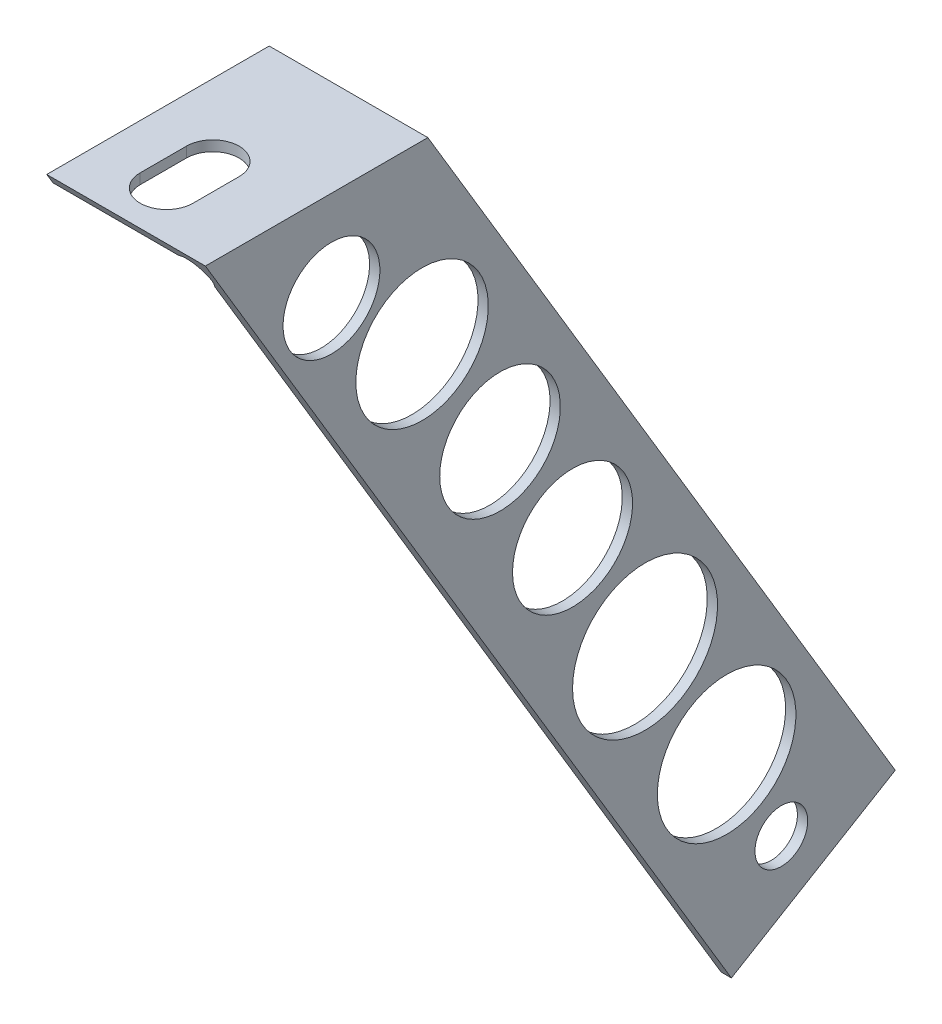
ISO-10303-21;
HEADER;
FILE_DESCRIPTION(('STEP AP214'),'2;1');
FILE_NAME('part.step','',(''),(''),'','','');
FILE_SCHEMA(('AUTOMOTIVE_DESIGN { 1 0 10303 214 1 1 1 1 }'));
ENDSEC;
DATA;
#1=APPLICATION_CONTEXT('core data for automotive mechanical design processes');
#2=APPLICATION_PROTOCOL_DEFINITION('international standard','automotive_design',2000,#1);
#3=PRODUCT_CONTEXT('',#1,'mechanical');
#4=PRODUCT('Part','Part','',(#3));
#5=PRODUCT_RELATED_PRODUCT_CATEGORY('part','',(#4));
#6=PRODUCT_DEFINITION_FORMATION('','',#4);
#7=PRODUCT_DEFINITION_CONTEXT('part definition',#1,'design');
#8=PRODUCT_DEFINITION('design','',#6,#7);
#9=PRODUCT_DEFINITION_SHAPE('','',#8);
#10=(LENGTH_UNIT() NAMED_UNIT(*) SI_UNIT(.MILLI.,.METRE.));
#11=(NAMED_UNIT(*) PLANE_ANGLE_UNIT() SI_UNIT($,.RADIAN.));
#12=(NAMED_UNIT(*) SI_UNIT($,.STERADIAN.) SOLID_ANGLE_UNIT());
#13=UNCERTAINTY_MEASURE_WITH_UNIT(LENGTH_MEASURE(1.E-05),#10,'distance_accuracy_value','');
#14=(GEOMETRIC_REPRESENTATION_CONTEXT(3) GLOBAL_UNCERTAINTY_ASSIGNED_CONTEXT((#13)) GLOBAL_UNIT_ASSIGNED_CONTEXT((#10,
#11,#12)) REPRESENTATION_CONTEXT('',''));
#15=CARTESIAN_POINT('',(0.,0.,0.));
#16=DIRECTION('',(0.,0.,1.));
#17=DIRECTION('',(1.,0.,0.));
#18=AXIS2_PLACEMENT_3D('',#15,#16,#17);
#19=CARTESIAN_POINT('',(-20.828,3.61949999999996,58.42));
#20=DIRECTION('',(0.,-1.,0.));
#21=DIRECTION('',(0.,0.,-1.));
#22=AXIS2_PLACEMENT_3D('',#19,#20,#21);
#23=PLANE('',#22);
#24=DIRECTION('',(0.,0.,-1.));
#25=VECTOR('',#24,1.);
#26=CARTESIAN_POINT('',(-5.71500000000001,3.61949999999996,-144.8435));
#27=LINE('',#26,#25);
#28=CARTESIAN_POINT('',(-5.715,3.61949999999996,-137.7315));
#29=VERTEX_POINT('',#28);
#30=CARTESIAN_POINT('',(-5.71500000000001,3.61949999999996,-144.8435));
#31=VERTEX_POINT('',#30);
#32=EDGE_CURVE('E136',#29,#31,#27,.T.);
#33=ORIENTED_EDGE('',*,*,#32,.F.);
#34=CARTESIAN_POINT('',(-9.779,3.61949999999996,-137.7315));
#35=DIRECTION('',(0.,1.,0.));
#36=DIRECTION('',(0.,0.,-1.));
#37=AXIS2_PLACEMENT_3D('',#34,#35,#36);
#38=CIRCLE('',#37,4.064);
#39=CARTESIAN_POINT('',(-13.843,3.61949999999996,-137.7315));
#40=VERTEX_POINT('',#39);
#41=EDGE_CURVE('E55',#40,#29,#38,.T.);
#42=ORIENTED_EDGE('',*,*,#41,.F.);
#43=DIRECTION('',(0.,0.,1.));
#44=VECTOR('',#43,1.);
#45=CARTESIAN_POINT('',(-13.843,3.61949999999996,-144.8435));
#46=LINE('',#45,#44);
#47=CARTESIAN_POINT('',(-13.843,3.61949999999996,-144.8435));
#48=VERTEX_POINT('',#47);
#49=EDGE_CURVE('E143',#48,#40,#46,.T.);
#50=ORIENTED_EDGE('',*,*,#49,.F.);
#51=CARTESIAN_POINT('',(-9.779,3.61949999999996,-144.8435));
#52=DIRECTION('',(0.,1.,0.));
#53=DIRECTION('',(0.,0.,-1.));
#54=AXIS2_PLACEMENT_3D('',#51,#52,#53);
#55=CIRCLE('',#54,4.064);
#56=EDGE_CURVE('E126',#31,#48,#55,.T.);
#57=ORIENTED_EDGE('',*,*,#56,.F.);
#58=EDGE_LOOP('',(#33,#42,#50,#57));
#59=FACE_BOUND('',#58,.T.);
#60=DIRECTION('',(0.,0.,-1.));
#61=VECTOR('',#60,1.);
#62=CARTESIAN_POINT('',(-20.828,3.61949999999996,58.42));
#63=LINE('',#62,#61);
#64=CARTESIAN_POINT('',(-20.828,3.61949999999996,-130.306990872924));
#65=VERTEX_POINT('',#64);
#66=CARTESIAN_POINT('',(-20.828,3.61949999999996,-164.593410127905));
#67=VERTEX_POINT('',#66);
#68=EDGE_CURVE('E218',#65,#67,#63,.T.);
#69=ORIENTED_EDGE('',*,*,#68,.F.);
#70=DIRECTION('',(1.,0.,0.));
#71=VECTOR('',#70,1.);
#72=CARTESIAN_POINT('',(-20.828,3.61949999999996,-130.306990872924));
#73=LINE('',#72,#71);
#74=CARTESIAN_POINT('',(3.61949999999996,3.61949999999996,-130.306990872924));
#75=VERTEX_POINT('',#74);
#76=EDGE_CURVE('E182',#65,#75,#73,.T.);
#77=ORIENTED_EDGE('',*,*,#76,.T.);
#78=DIRECTION('',(0.,0.,-1.));
#79=VECTOR('',#78,1.);
#80=CARTESIAN_POINT('',(3.61949999999996,3.61949999999996,58.42));
#81=LINE('',#80,#79);
#82=CARTESIAN_POINT('',(3.61949999999996,3.61949999999996,-164.593410127905));
#83=VERTEX_POINT('',#82);
#84=EDGE_CURVE('E222',#75,#83,#81,.T.);
#85=ORIENTED_EDGE('',*,*,#84,.T.);
#86=DIRECTION('',(1.,0.,0.));
#87=VECTOR('',#86,1.);
#88=CARTESIAN_POINT('',(-20.828,3.61949999999996,-164.593410127905));
#89=LINE('',#88,#87);
#90=EDGE_CURVE('E171',#67,#83,#89,.T.);
#91=ORIENTED_EDGE('',*,*,#90,.F.);
#92=EDGE_LOOP('',(#69,#77,#85,#91));
#93=FACE_BOUND('',#92,.T.);
#94=ADVANCED_FACE('F39',(#59,#93),#23,.F.);
#95=CARTESIAN_POINT('',(3.61949999999996,3.61949999999996,58.42));
#96=DIRECTION('',(-1.,0.,0.));
#97=DIRECTION('',(0.,-1.,0.));
#98=AXIS2_PLACEMENT_3D('',#95,#96,#97);
#99=PLANE('',#98);
#100=CARTESIAN_POINT('',(3.61949999999997,-23.5120752505727,-163.706593350607));
#101=DIRECTION('',(-1.,0.,0.));
#102=DIRECTION('',(0.,0.,1.));
#103=AXIS2_PLACEMENT_3D('',#100,#101,#102);
#104=CIRCLE('',#103,10.2077078609216);
#105=CARTESIAN_POINT('',(3.61949999999997,-23.5120752505727,-153.498885489685));
#106=VERTEX_POINT('',#105);
#107=EDGE_CURVE('E452',#106,#106,#104,.T.);
#108=ORIENTED_EDGE('',*,*,#107,.T.);
#109=EDGE_LOOP('',(#108));
#110=FACE_BOUND('',#109,.T.);
#111=CARTESIAN_POINT('',(3.61949999999997,-10.3812897552228,-149.737672610873));
#112=DIRECTION('',(-1.,0.,0.));
#113=DIRECTION('',(0.,0.,1.));
#114=AXIS2_PLACEMENT_3D('',#111,#112,#113);
#115=CIRCLE('',#114,7.46062669847059);
#116=CARTESIAN_POINT('',(3.61949999999997,-10.3812897552228,-142.277045912402));
#117=VERTEX_POINT('',#116);
#118=EDGE_CURVE('E457',#117,#117,#115,.T.);
#119=ORIENTED_EDGE('',*,*,#118,.T.);
#120=EDGE_LOOP('',(#119));
#121=FACE_BOUND('',#120,.T.);
#122=CARTESIAN_POINT('',(3.61949999999997,-60.9487828330599,-186.895001778565));
#123=DIRECTION('',(-1.,0.,0.));
#124=DIRECTION('',(0.,0.,1.));
#125=AXIS2_PLACEMENT_3D('',#122,#123,#124);
#126=CIRCLE('',#125,9.25117710610354);
#127=CARTESIAN_POINT('',(3.61949999999997,-60.9487828330599,-177.643824672462));
#128=VERTEX_POINT('',#127);
#129=EDGE_CURVE('E476',#128,#128,#126,.T.);
#130=ORIENTED_EDGE('',*,*,#129,.T.);
#131=EDGE_LOOP('',(#130));
#132=FACE_BOUND('',#131,.T.);
#133=CARTESIAN_POINT('',(3.61949999999997,-42.509807456611,-175.719865186778));
#134=DIRECTION('',(-1.,0.,0.));
#135=DIRECTION('',(0.,0.,1.));
#136=AXIS2_PLACEMENT_3D('',#133,#134,#135);
#137=CIRCLE('',#136,9.29439592114853);
#138=CARTESIAN_POINT('',(3.61949999999997,-42.509807456611,-166.42546926563));
#139=VERTEX_POINT('',#138);
#140=EDGE_CURVE('E468',#139,#139,#137,.T.);
#141=ORIENTED_EDGE('',*,*,#140,.T.);
#142=EDGE_LOOP('',(#141));
#143=FACE_BOUND('',#142,.T.);
#144=CARTESIAN_POINT('',(3.61949999999997,-81.0640286982769,-198.070138370352));
#145=DIRECTION('',(-1.,0.,0.));
#146=DIRECTION('',(0.,0.,1.));
#147=AXIS2_PLACEMENT_3D('',#144,#145,#146);
#148=CIRCLE('',#147,11.174016497498);
#149=CARTESIAN_POINT('',(3.61949999999997,-81.0640286982769,-186.896121872855));
#150=VERTEX_POINT('',#149);
#151=EDGE_CURVE('E512',#150,#150,#148,.T.);
#152=ORIENTED_EDGE('',*,*,#151,.T.);
#153=EDGE_LOOP('',(#152));
#154=FACE_BOUND('',#153,.T.);
#155=CARTESIAN_POINT('',(3.61949999999997,-101.738031393083,-210.642167036113));
#156=DIRECTION('',(-1.,0.,0.));
#157=DIRECTION('',(0.,0.,1.));
#158=AXIS2_PLACEMENT_3D('',#155,#156,#157);
#159=CIRCLE('',#158,10.6767798096192);
#160=CARTESIAN_POINT('',(3.61949999999997,-101.738031393083,-199.965387226494));
#161=VERTEX_POINT('',#160);
#162=EDGE_CURVE('E484',#161,#161,#159,.T.);
#163=ORIENTED_EDGE('',*,*,#162,.T.);
#164=EDGE_LOOP('',(#163));
#165=FACE_BOUND('',#164,.T.);
#166=CARTESIAN_POINT('',(3.61949999999996,-116.84,-219.075));
#167=DIRECTION('',(1.,0.,0.));
#168=DIRECTION('',(0.,0.,-1.));
#169=AXIS2_PLACEMENT_3D('',#166,#167,#168);
#170=CIRCLE('',#169,4.06400000000002);
#171=CARTESIAN_POINT('',(3.61949999999996,-116.84,-223.139));
#172=VERTEX_POINT('',#171);
#173=EDGE_CURVE('E153',#172,#172,#170,.T.);
#174=ORIENTED_EDGE('',*,*,#173,.F.);
#175=EDGE_LOOP('',(#174));
#176=FACE_BOUND('',#175,.T.);
#177=ORIENTED_EDGE('',*,*,#84,.F.);
#178=DIRECTION('',(0.,0.858242257535087,0.513244802585547));
#179=VECTOR('',#178,1.);
#180=CARTESIAN_POINT('',(3.61949999999996,-131.942769206397,-211.375744463214));
#181=LINE('',#180,#179);
#182=CARTESIAN_POINT('',(3.61949999999996,-131.942769206397,-211.375744463214));
#183=VERTEX_POINT('',#182);
#184=EDGE_CURVE('E167',#183,#75,#181,.T.);
#185=ORIENTED_EDGE('',*,*,#184,.F.);
#186=DIRECTION('',(0.,-0.513244802585547,0.858242257535087));
#187=VECTOR('',#186,1.);
#188=CARTESIAN_POINT('',(3.61949999999996,-116.84,-236.630427361965));
#189=LINE('',#188,#187);
#190=CARTESIAN_POINT('',(3.61949999999996,-116.84,-236.630427361965));
#191=VERTEX_POINT('',#190);
#192=EDGE_CURVE('E176',#191,#183,#189,.T.);
#193=ORIENTED_EDGE('',*,*,#192,.F.);
#194=DIRECTION('',(0.,-0.858242257535087,-0.513244802585547));
#195=VECTOR('',#194,1.);
#196=CARTESIAN_POINT('',(3.61949999999996,3.61949999999996,-164.593410127905));
#197=LINE('',#196,#195);
#198=EDGE_CURVE('E172',#83,#191,#197,.T.);
#199=ORIENTED_EDGE('',*,*,#198,.F.);
#200=EDGE_LOOP('',(#177,#185,#193,#199));
#201=FACE_BOUND('',#200,.T.);
#202=ADVANCED_FACE('F271',(#110,#121,#132,#143,#154,#165,#176,#201),#99,.F.);
#203=CARTESIAN_POINT('',(0.,0.,58.42));
#204=DIRECTION('',(0.,0.,-1.));
#205=DIRECTION('',(-1.,0.,0.));
#206=AXIS2_PLACEMENT_3D('',#203,#204,#205);
#207=CYLINDRICAL_SURFACE('',#206,2.45407656601503);
#208=DIRECTION('',(0.,0.,-1.));
#209=VECTOR('',#208,1.);
#210=CARTESIAN_POINT('',(2.032,-1.37603335419757,58.42));
#211=LINE('',#210,#209);
#212=CARTESIAN_POINT('',(2.032,-1.37603335419757,-133.294412556807));
#213=VERTEX_POINT('',#212);
#214=CARTESIAN_POINT('',(2.032,-1.37603335419757,-167.580831811787));
#215=VERTEX_POINT('',#214);
#216=EDGE_CURVE('E226',#213,#215,#211,.T.);
#217=ORIENTED_EDGE('',*,*,#216,.F.);
#218=CARTESIAN_POINT('',(0.,0.,-132.47151906604));
#219=DIRECTION('',(0.,0.513244802585547,-0.858242257535087));
#220=DIRECTION('',(0.,-0.858242257535087,-0.513244802585547));
#221=AXIS2_PLACEMENT_3D('',#218,#219,#220);
#222=ELLIPSE('',#221,2.85942173607631,2.45407656601503);
#223=CARTESIAN_POINT('',(-1.37603335419754,2.03199999999996,-131.256345343589));
#224=VERTEX_POINT('',#223);
#225=EDGE_CURVE('E202',#213,#224,#222,.F.);
#226=ORIENTED_EDGE('',*,*,#225,.T.);
#227=DIRECTION('',(0.,0.,-1.));
#228=VECTOR('',#227,1.);
#229=CARTESIAN_POINT('',(-1.37603335419754,2.03199999999996,58.42));
#230=LINE('',#229,#228);
#231=CARTESIAN_POINT('',(-1.37603335419754,2.03199999999996,-165.54276459857));
#232=VERTEX_POINT('',#231);
#233=EDGE_CURVE('E210',#224,#232,#230,.T.);
#234=ORIENTED_EDGE('',*,*,#233,.T.);
#235=CARTESIAN_POINT('',(0.,0.,-166.757938321021));
#236=DIRECTION('',(0.,-0.513244802585547,0.858242257535087));
#237=DIRECTION('',(0.,-0.858242257535087,-0.513244802585547));
#238=AXIS2_PLACEMENT_3D('',#235,#236,#237);
#239=ELLIPSE('',#238,2.85942173607631,2.45407656601503);
#240=EDGE_CURVE('E186',#232,#215,#239,.F.);
#241=ORIENTED_EDGE('',*,*,#240,.T.);
#242=EDGE_LOOP('',(#217,#226,#234,#241));
#243=FACE_BOUND('',#242,.T.);
#244=ADVANCED_FACE('F276',(#243),#207,.F.);
#245=CARTESIAN_POINT('',(-20.828,2.03200000000003,-165.1));
#246=DIRECTION('',(1.,0.,0.));
#247=DIRECTION('',(0.,0.,-1.));
#248=AXIS2_PLACEMENT_3D('',#245,#246,#247);
#249=PLANE('',#248);
#250=DIRECTION('',(0.,0.,-1.));
#251=VECTOR('',#250,1.);
#252=CARTESIAN_POINT('',(-20.828,2.03199999999997,58.42));
#253=LINE('',#252,#251);
#254=CARTESIAN_POINT('',(-20.828,2.03199999999997,-131.256345343589));
#255=VERTEX_POINT('',#254);
#256=CARTESIAN_POINT('',(-20.828,2.03199999999997,-165.54276459857));
#257=VERTEX_POINT('',#256);
#258=EDGE_CURVE('E214',#255,#257,#253,.T.);
#259=ORIENTED_EDGE('',*,*,#258,.F.);
#260=DIRECTION('',(0.,0.858242257535087,0.513244802585547));
#261=VECTOR('',#260,1.);
#262=CARTESIAN_POINT('',(-20.828,-131.942769206397,-211.375744463214));
#263=LINE('',#262,#261);
#264=EDGE_CURVE('E166',#255,#65,#263,.T.);
#265=ORIENTED_EDGE('',*,*,#264,.T.);
#266=ORIENTED_EDGE('',*,*,#68,.T.);
#267=DIRECTION('',(0.,-0.858242257535087,-0.513244802585547));
#268=VECTOR('',#267,1.);
#269=CARTESIAN_POINT('',(-20.828,3.61949999999996,-164.593410127905));
#270=LINE('',#269,#268);
#271=EDGE_CURVE('E162',#67,#257,#270,.T.);
#272=ORIENTED_EDGE('',*,*,#271,.T.);
#273=EDGE_LOOP('',(#259,#265,#266,#272));
#274=FACE_BOUND('',#273,.T.);
#275=ADVANCED_FACE('F41',(#274),#249,.F.);
#276=CARTESIAN_POINT('',(-1.37603335419754,2.03199999999996,58.42));
#277=DIRECTION('',(0.,1.,0.));
#278=DIRECTION('',(-1.,0.,0.));
#279=AXIS2_PLACEMENT_3D('',#276,#277,#278);
#280=PLANE('',#279);
#281=DIRECTION('',(0.,0.,1.));
#282=VECTOR('',#281,1.);
#283=CARTESIAN_POINT('',(-13.843,2.03199999999997,58.42));
#284=LINE('',#283,#282);
#285=CARTESIAN_POINT('',(-13.843,2.03199999999998,-144.8435));
#286=VERTEX_POINT('',#285);
#287=CARTESIAN_POINT('',(-13.843,2.03199999999998,-137.7315));
#288=VERTEX_POINT('',#287);
#289=EDGE_CURVE('E48',#286,#288,#284,.T.);
#290=ORIENTED_EDGE('',*,*,#289,.T.);
#291=CARTESIAN_POINT('',(-9.779,2.03199999999998,-137.7315));
#292=DIRECTION('',(0.,1.,0.));
#293=DIRECTION('',(-1.,0.,0.));
#294=AXIS2_PLACEMENT_3D('',#291,#292,#293);
#295=CIRCLE('',#294,4.064);
#296=CARTESIAN_POINT('',(-5.715,2.03199999999998,-137.7315));
#297=VERTEX_POINT('',#296);
#298=EDGE_CURVE('E11',#288,#297,#295,.T.);
#299=ORIENTED_EDGE('',*,*,#298,.T.);
#300=DIRECTION('',(0.,0.,-1.));
#301=VECTOR('',#300,1.);
#302=CARTESIAN_POINT('',(-5.71499999999981,2.03199999999997,58.42));
#303=LINE('',#302,#301);
#304=CARTESIAN_POINT('',(-5.71500000000001,2.03199999999997,-144.8435));
#305=VERTEX_POINT('',#304);
#306=EDGE_CURVE('E242',#297,#305,#303,.T.);
#307=ORIENTED_EDGE('',*,*,#306,.T.);
#308=CARTESIAN_POINT('',(-9.779,2.03199999999998,-144.8435));
#309=DIRECTION('',(0.,1.,0.));
#310=DIRECTION('',(-1.,0.,0.));
#311=AXIS2_PLACEMENT_3D('',#308,#309,#310);
#312=CIRCLE('',#311,4.064);
#313=EDGE_CURVE('E129',#305,#286,#312,.T.);
#314=ORIENTED_EDGE('',*,*,#313,.T.);
#315=EDGE_LOOP('',(#290,#299,#307,#314));
#316=FACE_BOUND('',#315,.T.);
#317=ORIENTED_EDGE('',*,*,#233,.F.);
#318=DIRECTION('',(-1.,0.,0.));
#319=VECTOR('',#318,1.);
#320=CARTESIAN_POINT('',(-1.37603335419757,2.03199999999996,-131.256345343589));
#321=LINE('',#320,#319);
#322=EDGE_CURVE('E206',#224,#255,#321,.T.);
#323=ORIENTED_EDGE('',*,*,#322,.T.);
#324=ORIENTED_EDGE('',*,*,#258,.T.);
#325=DIRECTION('',(1.,0.,0.));
#326=VECTOR('',#325,1.);
#327=CARTESIAN_POINT('',(-1.37603335419757,2.03199999999996,-165.54276459857));
#328=LINE('',#327,#326);
#329=EDGE_CURVE('E198',#257,#232,#328,.T.);
#330=ORIENTED_EDGE('',*,*,#329,.T.);
#331=EDGE_LOOP('',(#317,#323,#324,#330));
#332=FACE_BOUND('',#331,.T.);
#333=ADVANCED_FACE('F252',(#316,#332),#280,.F.);
#334=CARTESIAN_POINT('',(2.032,-161.29,58.42));
#335=DIRECTION('',(1.,0.,0.));
#336=DIRECTION('',(0.,0.,-1.));
#337=AXIS2_PLACEMENT_3D('',#334,#335,#336);
#338=PLANE('',#337);
#339=CARTESIAN_POINT('',(2.032,-23.5120752505727,-163.706593350607));
#340=DIRECTION('',(-1.,0.,0.));
#341=DIRECTION('',(0.,0.,1.));
#342=AXIS2_PLACEMENT_3D('',#339,#340,#341);
#343=CIRCLE('',#342,10.2077078609216);
#344=CARTESIAN_POINT('',(2.032,-23.5120752505727,-153.498885489685));
#345=VERTEX_POINT('',#344);
#346=EDGE_CURVE('E455',#345,#345,#343,.T.);
#347=ORIENTED_EDGE('',*,*,#346,.F.);
#348=EDGE_LOOP('',(#347));
#349=FACE_BOUND('',#348,.T.);
#350=CARTESIAN_POINT('',(2.032,-10.3812897552228,-149.737672610873));
#351=DIRECTION('',(-1.,0.,0.));
#352=DIRECTION('',(0.,0.,1.));
#353=AXIS2_PLACEMENT_3D('',#350,#351,#352);
#354=CIRCLE('',#353,7.46062669847059);
#355=CARTESIAN_POINT('',(2.032,-10.3812897552228,-142.277045912402));
#356=VERTEX_POINT('',#355);
#357=EDGE_CURVE('E464',#356,#356,#354,.T.);
#358=ORIENTED_EDGE('',*,*,#357,.F.);
#359=EDGE_LOOP('',(#358));
#360=FACE_BOUND('',#359,.T.);
#361=CARTESIAN_POINT('',(2.032,-60.9487828330599,-186.895001778565));
#362=DIRECTION('',(-1.,0.,0.));
#363=DIRECTION('',(0.,0.,1.));
#364=AXIS2_PLACEMENT_3D('',#361,#362,#363);
#365=CIRCLE('',#364,9.25117710610354);
#366=CARTESIAN_POINT('',(2.032,-60.9487828330599,-177.643824672462));
#367=VERTEX_POINT('',#366);
#368=EDGE_CURVE('E472',#367,#367,#365,.T.);
#369=ORIENTED_EDGE('',*,*,#368,.F.);
#370=EDGE_LOOP('',(#369));
#371=FACE_BOUND('',#370,.T.);
#372=CARTESIAN_POINT('',(2.032,-42.509807456611,-175.719865186778));
#373=DIRECTION('',(-1.,0.,0.));
#374=DIRECTION('',(0.,0.,1.));
#375=AXIS2_PLACEMENT_3D('',#372,#373,#374);
#376=CIRCLE('',#375,9.29439592114853);
#377=CARTESIAN_POINT('',(2.032,-42.509807456611,-166.42546926563));
#378=VERTEX_POINT('',#377);
#379=EDGE_CURVE('E461',#378,#378,#376,.T.);
#380=ORIENTED_EDGE('',*,*,#379,.F.);
#381=EDGE_LOOP('',(#380));
#382=FACE_BOUND('',#381,.T.);
#383=CARTESIAN_POINT('',(2.032,-81.0640286982769,-198.070138370352));
#384=DIRECTION('',(-1.,0.,0.));
#385=DIRECTION('',(0.,0.,1.));
#386=AXIS2_PLACEMENT_3D('',#383,#384,#385);
#387=CIRCLE('',#386,11.174016497498);
#388=CARTESIAN_POINT('',(2.032,-81.0640286982769,-186.896121872855));
#389=VERTEX_POINT('',#388);
#390=EDGE_CURVE('E509',#389,#389,#387,.T.);
#391=ORIENTED_EDGE('',*,*,#390,.F.);
#392=EDGE_LOOP('',(#391));
#393=FACE_BOUND('',#392,.T.);
#394=CARTESIAN_POINT('',(2.032,-101.738031393083,-210.642167036113));
#395=DIRECTION('',(-1.,0.,0.));
#396=DIRECTION('',(0.,0.,1.));
#397=AXIS2_PLACEMENT_3D('',#394,#395,#396);
#398=CIRCLE('',#397,10.6767798096192);
#399=CARTESIAN_POINT('',(2.032,-101.738031393083,-199.965387226494));
#400=VERTEX_POINT('',#399);
#401=EDGE_CURVE('E480',#400,#400,#398,.T.);
#402=ORIENTED_EDGE('',*,*,#401,.F.);
#403=EDGE_LOOP('',(#402));
#404=FACE_BOUND('',#403,.T.);
#405=CARTESIAN_POINT('',(2.032,-116.84,-219.075));
#406=DIRECTION('',(1.,0.,0.));
#407=DIRECTION('',(0.,0.,-1.));
#408=AXIS2_PLACEMENT_3D('',#405,#406,#407);
#409=CIRCLE('',#408,4.06400000000002);
#410=CARTESIAN_POINT('',(2.032,-116.84,-223.139));
#411=VERTEX_POINT('',#410);
#412=EDGE_CURVE('E161',#411,#411,#409,.T.);
#413=ORIENTED_EDGE('',*,*,#412,.T.);
#414=EDGE_LOOP('',(#413));
#415=FACE_BOUND('',#414,.T.);
#416=DIRECTION('',(0.,-0.513244802585547,0.858242257535087));
#417=VECTOR('',#416,1.);
#418=CARTESIAN_POINT('',(2.032,-258.515313295525,0.277457739268294));
#419=LINE('',#418,#417);
#420=CARTESIAN_POINT('',(2.032,-116.84,-236.630427361965));
#421=VERTEX_POINT('',#420);
#422=CARTESIAN_POINT('',(2.032,-131.942769206397,-211.375744463214));
#423=VERTEX_POINT('',#422);
#424=EDGE_CURVE('E234',#421,#423,#419,.T.);
#425=ORIENTED_EDGE('',*,*,#424,.T.);
#426=DIRECTION('',(0.,0.858242257535087,0.513244802585547));
#427=VECTOR('',#426,1.);
#428=CARTESIAN_POINT('',(2.032,-34.7174559108727,-153.233202202482));
#429=LINE('',#428,#427);
#430=EDGE_CURVE('E238',#423,#213,#429,.T.);
#431=ORIENTED_EDGE('',*,*,#430,.T.);
#432=ORIENTED_EDGE('',*,*,#216,.T.);
#433=DIRECTION('',(0.,-0.858242257535087,-0.513244802585547));
#434=VECTOR('',#433,1.);
#435=CARTESIAN_POINT('',(2.032,-19.6146867044753,-178.487885101233));
#436=LINE('',#435,#434);
#437=EDGE_CURVE('E230',#215,#421,#436,.T.);
#438=ORIENTED_EDGE('',*,*,#437,.T.);
#439=EDGE_LOOP('',(#425,#431,#432,#438));
#440=FACE_BOUND('',#439,.T.);
#441=ADVANCED_FACE('F282',(#349,#360,#371,#382,#393,#404,#415,#440),#338,.F.);
#442=CARTESIAN_POINT('',(-20.828,-131.942769206397,-211.375744463214));
#443=DIRECTION('',(0.,0.513244802585547,-0.858242257535087));
#444=DIRECTION('',(0.,0.858242257535087,0.513244802585547));
#445=AXIS2_PLACEMENT_3D('',#442,#443,#444);
#446=PLANE('',#445);
#447=ORIENTED_EDGE('',*,*,#225,.F.);
#448=ORIENTED_EDGE('',*,*,#430,.F.);
#449=DIRECTION('',(1.,0.,0.));
#450=VECTOR('',#449,1.);
#451=CARTESIAN_POINT('',(-20.828,-131.942769206397,-211.375744463214));
#452=LINE('',#451,#450);
#453=EDGE_CURVE('E187',#423,#183,#452,.T.);
#454=ORIENTED_EDGE('',*,*,#453,.T.);
#455=ORIENTED_EDGE('',*,*,#184,.T.);
#456=ORIENTED_EDGE('',*,*,#76,.F.);
#457=ORIENTED_EDGE('',*,*,#264,.F.);
#458=ORIENTED_EDGE('',*,*,#322,.F.);
#459=EDGE_LOOP('',(#447,#448,#454,#455,#456,#457,#458));
#460=FACE_BOUND('',#459,.T.);
#461=ADVANCED_FACE('F284',(#460),#446,.F.);
#462=CARTESIAN_POINT('',(-20.828,-116.84,-236.630427361965));
#463=DIRECTION('',(0.,0.858242257535087,0.513244802585547));
#464=DIRECTION('',(0.,-0.513244802585547,0.858242257535087));
#465=AXIS2_PLACEMENT_3D('',#462,#463,#464);
#466=PLANE('',#465);
#467=DIRECTION('',(1.,0.,0.));
#468=VECTOR('',#467,1.);
#469=CARTESIAN_POINT('',(-20.828,-116.84,-236.630427361965));
#470=LINE('',#469,#468);
#471=EDGE_CURVE('E190',#421,#191,#470,.T.);
#472=ORIENTED_EDGE('',*,*,#471,.T.);
#473=ORIENTED_EDGE('',*,*,#192,.T.);
#474=ORIENTED_EDGE('',*,*,#453,.F.);
#475=ORIENTED_EDGE('',*,*,#424,.F.);
#476=EDGE_LOOP('',(#472,#473,#474,#475));
#477=FACE_BOUND('',#476,.T.);
#478=ADVANCED_FACE('F299',(#477),#466,.F.);
#479=CARTESIAN_POINT('',(-20.828,3.61949999999996,-164.593410127905));
#480=DIRECTION('',(0.,-0.513244802585547,0.858242257535087));
#481=DIRECTION('',(0.,-0.858242257535087,-0.513244802585547));
#482=AXIS2_PLACEMENT_3D('',#479,#480,#481);
#483=PLANE('',#482);
#484=ORIENTED_EDGE('',*,*,#271,.F.);
#485=ORIENTED_EDGE('',*,*,#90,.T.);
#486=ORIENTED_EDGE('',*,*,#198,.T.);
#487=ORIENTED_EDGE('',*,*,#471,.F.);
#488=ORIENTED_EDGE('',*,*,#437,.F.);
#489=ORIENTED_EDGE('',*,*,#240,.F.);
#490=ORIENTED_EDGE('',*,*,#329,.F.);
#491=EDGE_LOOP('',(#484,#485,#486,#487,#488,#489,#490));
#492=FACE_BOUND('',#491,.T.);
#493=ADVANCED_FACE('F266',(#492),#483,.F.);
#494=CARTESIAN_POINT('',(-20.828,-116.84,-219.075));
#495=DIRECTION('',(1.,0.,0.));
#496=DIRECTION('',(0.,0.,-1.));
#497=AXIS2_PLACEMENT_3D('',#494,#495,#496);
#498=CYLINDRICAL_SURFACE('',#497,4.06400000000002);
#499=ORIENTED_EDGE('',*,*,#173,.T.);
#500=EDGE_LOOP('',(#499));
#501=FACE_BOUND('',#500,.T.);
#502=ORIENTED_EDGE('',*,*,#412,.F.);
#503=EDGE_LOOP('',(#502));
#504=FACE_BOUND('',#503,.T.);
#505=ADVANCED_FACE('F259',(#501,#504),#498,.F.);
#506=CARTESIAN_POINT('',(-9.779,-131.942769206397,-137.7315));
#507=DIRECTION('',(0.,1.,0.));
#508=DIRECTION('',(0.,0.,1.));
#509=AXIS2_PLACEMENT_3D('',#506,#507,#508);
#510=CYLINDRICAL_SURFACE('',#509,4.064);
#511=DIRECTION('',(0.,1.,0.));
#512=VECTOR('',#511,1.);
#513=CARTESIAN_POINT('',(-13.843,-131.942769206397,-137.7315));
#514=LINE('',#513,#512);
#515=EDGE_CURVE('E150',#288,#40,#514,.T.);
#516=ORIENTED_EDGE('',*,*,#515,.T.);
#517=ORIENTED_EDGE('',*,*,#41,.T.);
#518=DIRECTION('',(0.,1.,0.));
#519=VECTOR('',#518,1.);
#520=CARTESIAN_POINT('',(-5.715,-131.942769206397,-137.7315));
#521=LINE('',#520,#519);
#522=EDGE_CURVE('E133',#297,#29,#521,.T.);
#523=ORIENTED_EDGE('',*,*,#522,.F.);
#524=ORIENTED_EDGE('',*,*,#298,.F.);
#525=EDGE_LOOP('',(#516,#517,#523,#524));
#526=FACE_BOUND('',#525,.T.);
#527=ADVANCED_FACE('F257',(#526),#510,.F.);
#528=CARTESIAN_POINT('',(-13.843,-131.942769206397,-144.8435));
#529=DIRECTION('',(-1.,0.,0.));
#530=DIRECTION('',(0.,0.,1.));
#531=AXIS2_PLACEMENT_3D('',#528,#529,#530);
#532=PLANE('',#531);
#533=DIRECTION('',(0.,1.,0.));
#534=VECTOR('',#533,1.);
#535=CARTESIAN_POINT('',(-13.843,-131.942769206397,-144.8435));
#536=LINE('',#535,#534);
#537=EDGE_CURVE('E132',#286,#48,#536,.T.);
#538=ORIENTED_EDGE('',*,*,#537,.T.);
#539=ORIENTED_EDGE('',*,*,#49,.T.);
#540=ORIENTED_EDGE('',*,*,#515,.F.);
#541=ORIENTED_EDGE('',*,*,#289,.F.);
#542=EDGE_LOOP('',(#538,#539,#540,#541));
#543=FACE_BOUND('',#542,.T.);
#544=ADVANCED_FACE('F256',(#543),#532,.F.);
#545=CARTESIAN_POINT('',(-9.779,-131.942769206397,-144.8435));
#546=DIRECTION('',(0.,1.,0.));
#547=DIRECTION('',(0.,0.,1.));
#548=AXIS2_PLACEMENT_3D('',#545,#546,#547);
#549=CYLINDRICAL_SURFACE('',#548,4.064);
#550=DIRECTION('',(0.,1.,0.));
#551=VECTOR('',#550,1.);
#552=CARTESIAN_POINT('',(-5.71500000000001,-131.942769206397,-144.8435));
#553=LINE('',#552,#551);
#554=EDGE_CURVE('E63',#305,#31,#553,.T.);
#555=ORIENTED_EDGE('',*,*,#554,.T.);
#556=ORIENTED_EDGE('',*,*,#56,.T.);
#557=ORIENTED_EDGE('',*,*,#537,.F.);
#558=ORIENTED_EDGE('',*,*,#313,.F.);
#559=EDGE_LOOP('',(#555,#556,#557,#558));
#560=FACE_BOUND('',#559,.T.);
#561=ADVANCED_FACE('F123',(#560),#549,.F.);
#562=CARTESIAN_POINT('',(-5.71500000000001,-131.942769206397,-144.8435));
#563=DIRECTION('',(1.,0.,0.));
#564=DIRECTION('',(0.,0.,-1.));
#565=AXIS2_PLACEMENT_3D('',#562,#563,#564);
#566=PLANE('',#565);
#567=ORIENTED_EDGE('',*,*,#522,.T.);
#568=ORIENTED_EDGE('',*,*,#32,.T.);
#569=ORIENTED_EDGE('',*,*,#554,.F.);
#570=ORIENTED_EDGE('',*,*,#306,.F.);
#571=EDGE_LOOP('',(#567,#568,#569,#570));
#572=FACE_BOUND('',#571,.T.);
#573=ADVANCED_FACE('F137',(#572),#566,.F.);
#574=CARTESIAN_POINT('',(3.61949999999997,-101.738031393083,-210.642167036113));
#575=DIRECTION('',(-1.,0.,0.));
#576=DIRECTION('',(0.,0.,1.));
#577=AXIS2_PLACEMENT_3D('',#574,#575,#576);
#578=CYLINDRICAL_SURFACE('',#577,10.6767798096192);
#579=ORIENTED_EDGE('',*,*,#162,.F.);
#580=EDGE_LOOP('',(#579));
#581=FACE_BOUND('',#580,.T.);
#582=ORIENTED_EDGE('',*,*,#401,.T.);
#583=EDGE_LOOP('',(#582));
#584=FACE_BOUND('',#583,.T.);
#585=ADVANCED_FACE('F377',(#581,#584),#578,.F.);
#586=CARTESIAN_POINT('',(3.61949999999997,-81.0640286982769,-198.070138370352));
#587=DIRECTION('',(-1.,0.,0.));
#588=DIRECTION('',(0.,0.,1.));
#589=AXIS2_PLACEMENT_3D('',#586,#587,#588);
#590=CYLINDRICAL_SURFACE('',#589,11.174016497498);
#591=ORIENTED_EDGE('',*,*,#151,.F.);
#592=EDGE_LOOP('',(#591));
#593=FACE_BOUND('',#592,.T.);
#594=ORIENTED_EDGE('',*,*,#390,.T.);
#595=EDGE_LOOP('',(#594));
#596=FACE_BOUND('',#595,.T.);
#597=ADVANCED_FACE('F395',(#593,#596),#590,.F.);
#598=CARTESIAN_POINT('',(3.61949999999997,-42.509807456611,-175.719865186778));
#599=DIRECTION('',(-1.,0.,0.));
#600=DIRECTION('',(0.,0.,1.));
#601=AXIS2_PLACEMENT_3D('',#598,#599,#600);
#602=CYLINDRICAL_SURFACE('',#601,9.29439592114853);
#603=ORIENTED_EDGE('',*,*,#140,.F.);
#604=EDGE_LOOP('',(#603));
#605=FACE_BOUND('',#604,.T.);
#606=ORIENTED_EDGE('',*,*,#379,.T.);
#607=EDGE_LOOP('',(#606));
#608=FACE_BOUND('',#607,.T.);
#609=ADVANCED_FACE('F405',(#605,#608),#602,.F.);
#610=CARTESIAN_POINT('',(3.61949999999997,-60.9487828330599,-186.895001778565));
#611=DIRECTION('',(-1.,0.,0.));
#612=DIRECTION('',(0.,0.,1.));
#613=AXIS2_PLACEMENT_3D('',#610,#611,#612);
#614=CYLINDRICAL_SURFACE('',#613,9.25117710610354);
#615=ORIENTED_EDGE('',*,*,#129,.F.);
#616=EDGE_LOOP('',(#615));
#617=FACE_BOUND('',#616,.T.);
#618=ORIENTED_EDGE('',*,*,#368,.T.);
#619=EDGE_LOOP('',(#618));
#620=FACE_BOUND('',#619,.T.);
#621=ADVANCED_FACE('F415',(#617,#620),#614,.F.);
#622=CARTESIAN_POINT('',(3.61949999999997,-10.3812897552228,-149.737672610873));
#623=DIRECTION('',(-1.,0.,0.));
#624=DIRECTION('',(0.,0.,1.));
#625=AXIS2_PLACEMENT_3D('',#622,#623,#624);
#626=CYLINDRICAL_SURFACE('',#625,7.46062669847059);
#627=ORIENTED_EDGE('',*,*,#118,.F.);
#628=EDGE_LOOP('',(#627));
#629=FACE_BOUND('',#628,.T.);
#630=ORIENTED_EDGE('',*,*,#357,.T.);
#631=EDGE_LOOP('',(#630));
#632=FACE_BOUND('',#631,.T.);
#633=ADVANCED_FACE('F425',(#629,#632),#626,.F.);
#634=CARTESIAN_POINT('',(3.61949999999997,-23.5120752505727,-163.706593350607));
#635=DIRECTION('',(-1.,0.,0.));
#636=DIRECTION('',(0.,0.,1.));
#637=AXIS2_PLACEMENT_3D('',#634,#635,#636);
#638=CYLINDRICAL_SURFACE('',#637,10.2077078609216);
#639=ORIENTED_EDGE('',*,*,#107,.F.);
#640=EDGE_LOOP('',(#639));
#641=FACE_BOUND('',#640,.T.);
#642=ORIENTED_EDGE('',*,*,#346,.T.);
#643=EDGE_LOOP('',(#642));
#644=FACE_BOUND('',#643,.T.);
#645=ADVANCED_FACE('F435',(#641,#644),#638,.F.);
#646=CLOSED_SHELL('',(#94,#202,#244,#275,#333,#441,#461,#478,#493,#505,#527,#544,#561,#573,#585,
#597,#609,#621,#633,#645));
#647=MANIFOLD_SOLID_BREP('B2',#646);
#648=ADVANCED_BREP_SHAPE_REPRESENTATION('',(#18,#647),#14);
#649=SHAPE_DEFINITION_REPRESENTATION(#9,#648);
ENDSEC;
END-ISO-10303-21;
